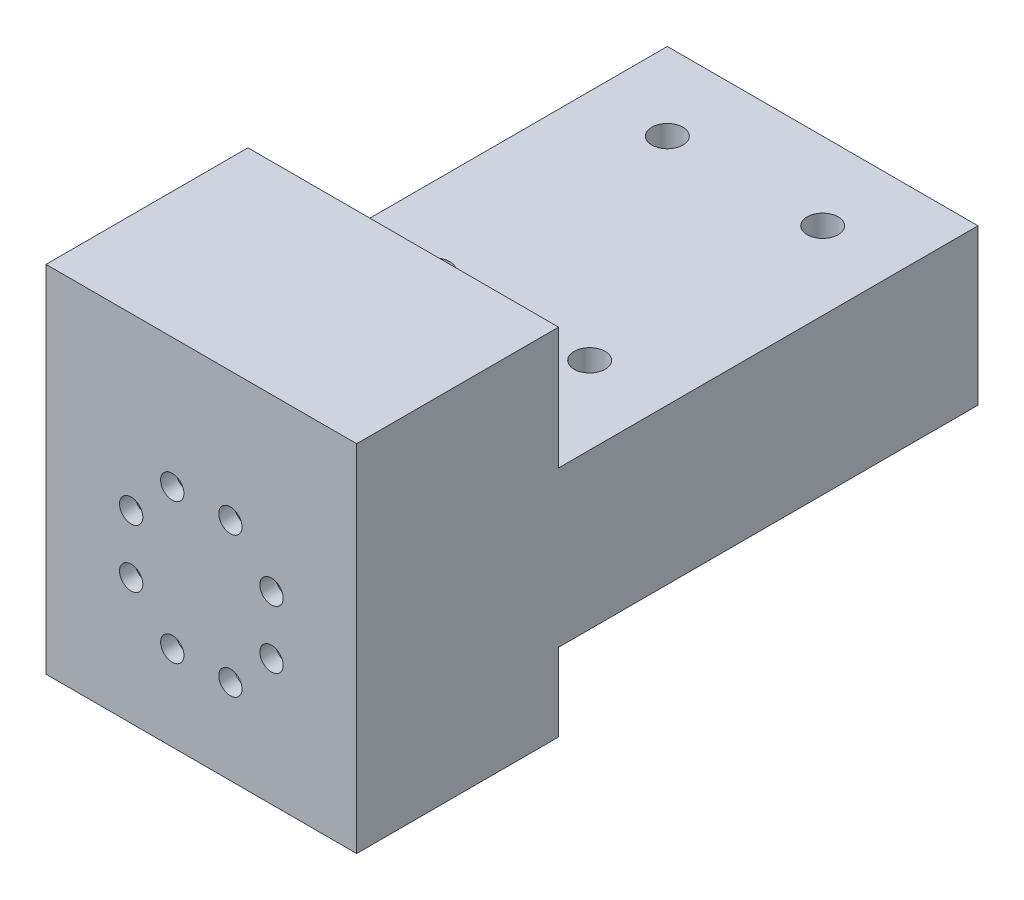
ISO-10303-21;
HEADER;
FILE_DESCRIPTION(('STEP AP214'),'2;1');
FILE_NAME('part.step','',(''),(''),'','','');
FILE_SCHEMA(('AUTOMOTIVE_DESIGN { 1 0 10303 214 1 1 1 1 }'));
ENDSEC;
DATA;
#1=APPLICATION_CONTEXT('core data for automotive mechanical design processes');
#2=APPLICATION_PROTOCOL_DEFINITION('international standard','automotive_design',2000,#1);
#3=PRODUCT_CONTEXT('',#1,'mechanical');
#4=PRODUCT('Part','Part','',(#3));
#5=PRODUCT_RELATED_PRODUCT_CATEGORY('part','',(#4));
#6=PRODUCT_DEFINITION_FORMATION('','',#4);
#7=PRODUCT_DEFINITION_CONTEXT('part definition',#1,'design');
#8=PRODUCT_DEFINITION('design','',#6,#7);
#9=PRODUCT_DEFINITION_SHAPE('','',#8);
#10=(LENGTH_UNIT() NAMED_UNIT(*) SI_UNIT(.MILLI.,.METRE.));
#11=(NAMED_UNIT(*) PLANE_ANGLE_UNIT() SI_UNIT($,.RADIAN.));
#12=(NAMED_UNIT(*) SI_UNIT($,.STERADIAN.) SOLID_ANGLE_UNIT());
#13=UNCERTAINTY_MEASURE_WITH_UNIT(LENGTH_MEASURE(1.E-05),#10,'distance_accuracy_value','');
#14=(GEOMETRIC_REPRESENTATION_CONTEXT(3) GLOBAL_UNCERTAINTY_ASSIGNED_CONTEXT((#13)) GLOBAL_UNIT_ASSIGNED_CONTEXT((#10,
#11,#12)) REPRESENTATION_CONTEXT('',''));
#15=CARTESIAN_POINT('',(0.,0.,0.));
#16=DIRECTION('',(0.,0.,1.));
#17=DIRECTION('',(1.,0.,0.));
#18=AXIS2_PLACEMENT_3D('',#15,#16,#17);
#19=CARTESIAN_POINT('',(0.,0.,-23.9999999999999));
#20=DIRECTION('',(0.,0.,-0.999999999999998));
#21=DIRECTION('',(-0.999999999999997,0.,0.));
#22=AXIS2_PLACEMENT_3D('',#19,#20,#21);
#23=PLANE('',#22);
#24=DIRECTION('',(-0.999999999999997,0.,0.));
#25=VECTOR('',#24,1.);
#26=CARTESIAN_POINT('',(19.9999999999998,-9.99999999999998,-23.9999999999999));
#27=LINE('',#26,#25);
#28=CARTESIAN_POINT('',(19.9999999999998,-10.,-23.9999999999999));
#29=VERTEX_POINT('',#28);
#30=CARTESIAN_POINT('',(-19.9999999999999,-10.,-23.9999999999999));
#31=VERTEX_POINT('',#30);
#32=EDGE_CURVE('E183',#29,#31,#27,.T.);
#33=ORIENTED_EDGE('',*,*,#32,.F.);
#34=DIRECTION('',(0.,-0.999999999999999,0.));
#35=VECTOR('',#34,1.);
#36=CARTESIAN_POINT('',(19.9999999999999,20.0000000000001,-23.9999999999998));
#37=LINE('',#36,#35);
#38=CARTESIAN_POINT('',(19.9999999999999,-20.,-23.9999999999999));
#39=VERTEX_POINT('',#38);
#40=EDGE_CURVE('E223',#29,#39,#37,.T.);
#41=ORIENTED_EDGE('',*,*,#40,.T.);
#42=DIRECTION('',(-0.999999999999997,0.,0.));
#43=VECTOR('',#42,1.);
#44=CARTESIAN_POINT('',(19.9999999999999,-20.,-23.9999999999999));
#45=LINE('',#44,#43);
#46=CARTESIAN_POINT('',(-20.,-19.9999999999998,-23.9999999999999));
#47=VERTEX_POINT('',#46);
#48=EDGE_CURVE('E222',#39,#47,#45,.T.);
#49=ORIENTED_EDGE('',*,*,#48,.T.);
#50=DIRECTION('',(0.,0.999999999999999,0.));
#51=VECTOR('',#50,1.);
#52=CARTESIAN_POINT('',(-19.9999999999999,20.,-23.9999999999999));
#53=LINE('',#52,#51);
#54=EDGE_CURVE('E227',#47,#31,#53,.T.);
#55=ORIENTED_EDGE('',*,*,#54,.T.);
#56=EDGE_LOOP('',(#33,#41,#49,#55));
#57=FACE_BOUND('',#56,.T.);
#58=ADVANCED_FACE('F38',(#57),#23,.T.);
#59=CARTESIAN_POINT('',(19.9999999999998,20.0000000000001,4.00000000000011));
#60=DIRECTION('',(-0.999999999999997,0.,0.));
#61=DIRECTION('',(0.,-0.999999999999999,0.));
#62=AXIS2_PLACEMENT_3D('',#59,#60,#61);
#63=PLANE('',#62);
#64=DIRECTION('',(0.,0.,0.999999999999998));
#65=VECTOR('',#64,1.);
#66=CARTESIAN_POINT('',(19.9999999999997,-9.99999999999984,-104.));
#67=LINE('',#66,#65);
#68=CARTESIAN_POINT('',(19.9999999999998,-9.99999999999998,-77.9999999999997));
#69=VERTEX_POINT('',#68);
#70=EDGE_CURVE('E189',#69,#29,#67,.T.);
#71=ORIENTED_EDGE('',*,*,#70,.F.);
#72=DIRECTION('',(0.,-0.999999999999999,0.));
#73=VECTOR('',#72,1.);
#74=CARTESIAN_POINT('',(19.9999999999997,10.0000000000001,-77.9999999999997));
#75=LINE('',#74,#73);
#76=CARTESIAN_POINT('',(19.9999999999997,10.0000000000001,-77.9999999999997));
#77=VERTEX_POINT('',#76);
#78=EDGE_CURVE('E55',#77,#69,#75,.T.);
#79=ORIENTED_EDGE('',*,*,#78,.F.);
#80=DIRECTION('',(0.,0.,0.999999999999998));
#81=VECTOR('',#80,1.);
#82=CARTESIAN_POINT('',(19.9999999999997,9.99999999999998,-104.));
#83=LINE('',#82,#81);
#84=CARTESIAN_POINT('',(19.9999999999998,10.0000000000002,-23.9999999999999));
#85=VERTEX_POINT('',#84);
#86=EDGE_CURVE('E191',#77,#85,#83,.T.);
#87=ORIENTED_EDGE('',*,*,#86,.T.);
#88=CARTESIAN_POINT('',(20.,25.7,-23.9999999999999));
#89=VERTEX_POINT('',#88);
#90=EDGE_CURVE('E219',#89,#85,#37,.T.);
#91=ORIENTED_EDGE('',*,*,#90,.F.);
#92=DIRECTION('',(0.,0.,-1.));
#93=VECTOR('',#92,1.);
#94=CARTESIAN_POINT('',(20.,25.7,-23.9999999999999));
#95=LINE('',#94,#93);
#96=CARTESIAN_POINT('',(20.,25.7,2.));
#97=VERTEX_POINT('',#96);
#98=EDGE_CURVE('E150',#97,#89,#95,.T.);
#99=ORIENTED_EDGE('',*,*,#98,.F.);
#100=DIRECTION('',(0.,0.999999999999999,0.));
#101=VECTOR('',#100,1.);
#102=CARTESIAN_POINT('',(20.,20.,2.));
#103=LINE('',#102,#101);
#104=CARTESIAN_POINT('',(19.9999999999999,-20.,2.00000000000011));
#105=VERTEX_POINT('',#104);
#106=EDGE_CURVE('E146',#105,#97,#103,.T.);
#107=ORIENTED_EDGE('',*,*,#106,.F.);
#108=DIRECTION('',(0.,0.,-0.999999999999998));
#109=VECTOR('',#108,1.);
#110=CARTESIAN_POINT('',(19.9999999999999,-19.9999999999998,4.));
#111=LINE('',#110,#109);
#112=EDGE_CURVE('E47',#105,#39,#111,.T.);
#113=ORIENTED_EDGE('',*,*,#112,.T.);
#114=ORIENTED_EDGE('',*,*,#40,.F.);
#115=EDGE_LOOP('',(#71,#79,#87,#91,#99,#107,#113,#114));
#116=FACE_BOUND('',#115,.T.);
#117=ADVANCED_FACE('F40',(#116),#63,.F.);
#118=CARTESIAN_POINT('',(-19.9999999999999,20.,3.99999999999995));
#119=DIRECTION('',(0.999999999999997,0.,0.));
#120=DIRECTION('',(0.,0.999999999999999,0.));
#121=AXIS2_PLACEMENT_3D('',#118,#119,#120);
#122=PLANE('',#121);
#123=DIRECTION('',(0.,0.,0.999999999999998));
#124=VECTOR('',#123,1.);
#125=CARTESIAN_POINT('',(-19.9999999999999,10.,-104.));
#126=LINE('',#125,#124);
#127=CARTESIAN_POINT('',(-19.9999999999999,10.0000000000002,-78.));
#128=VERTEX_POINT('',#127);
#129=CARTESIAN_POINT('',(-19.9999999999999,10.0000000000001,-23.9999999999999));
#130=VERTEX_POINT('',#129);
#131=EDGE_CURVE('E63',#128,#130,#126,.T.);
#132=ORIENTED_EDGE('',*,*,#131,.F.);
#133=DIRECTION('',(0.,0.999999999999999,0.));
#134=VECTOR('',#133,1.);
#135=CARTESIAN_POINT('',(-19.9999999999999,10.0000000000002,-78.));
#136=LINE('',#135,#134);
#137=CARTESIAN_POINT('',(-20.,-9.99999999999993,-77.9999999999997));
#138=VERTEX_POINT('',#137);
#139=EDGE_CURVE('E160',#138,#128,#136,.T.);
#140=ORIENTED_EDGE('',*,*,#139,.F.);
#141=DIRECTION('',(0.,0.,0.999999999999998));
#142=VECTOR('',#141,1.);
#143=CARTESIAN_POINT('',(-20.0000000000001,-9.99999999999984,-104.));
#144=LINE('',#143,#142);
#145=EDGE_CURVE('E187',#138,#31,#144,.T.);
#146=ORIENTED_EDGE('',*,*,#145,.T.);
#147=ORIENTED_EDGE('',*,*,#54,.F.);
#148=DIRECTION('',(0.,0.,-0.999999999999998));
#149=VECTOR('',#148,1.);
#150=CARTESIAN_POINT('',(-19.9999999999999,-20.,3.99999999999995));
#151=LINE('',#150,#149);
#152=CARTESIAN_POINT('',(-20.,-20.,2.));
#153=VERTEX_POINT('',#152);
#154=EDGE_CURVE('E11',#153,#47,#151,.T.);
#155=ORIENTED_EDGE('',*,*,#154,.F.);
#156=DIRECTION('',(0.,-0.999999999999999,0.));
#157=VECTOR('',#156,1.);
#158=CARTESIAN_POINT('',(-20.,20.0000000000001,2.));
#159=LINE('',#158,#157);
#160=CARTESIAN_POINT('',(-19.9999999999999,25.7,2.));
#161=VERTEX_POINT('',#160);
#162=EDGE_CURVE('E130',#161,#153,#159,.T.);
#163=ORIENTED_EDGE('',*,*,#162,.F.);
#164=DIRECTION('',(0.,0.,1.));
#165=VECTOR('',#164,1.);
#166=CARTESIAN_POINT('',(-19.9999999999999,25.7,-23.9999999999999));
#167=LINE('',#166,#165);
#168=CARTESIAN_POINT('',(-19.9999999999999,25.7,-23.9999999999999));
#169=VERTEX_POINT('',#168);
#170=EDGE_CURVE('E135',#169,#161,#167,.T.);
#171=ORIENTED_EDGE('',*,*,#170,.F.);
#172=EDGE_CURVE('E226',#130,#169,#53,.T.);
#173=ORIENTED_EDGE('',*,*,#172,.F.);
#174=EDGE_LOOP('',(#132,#140,#146,#147,#155,#163,#171,#173));
#175=FACE_BOUND('',#174,.T.);
#176=ADVANCED_FACE('F132',(#175),#122,.F.);
#177=CARTESIAN_POINT('',(-19.9999999999999,-20.,3.99999999999995));
#178=DIRECTION('',(0.,0.999999999999999,0.));
#179=DIRECTION('',(0.,0.,0.999999999999998));
#180=AXIS2_PLACEMENT_3D('',#177,#178,#179);
#181=PLANE('',#180);
#182=DIRECTION('',(-0.999999999999997,0.,0.));
#183=VECTOR('',#182,1.);
#184=CARTESIAN_POINT('',(19.9999999999999,-20.,-19.9999999999999));
#185=LINE('',#184,#183);
#186=CARTESIAN_POINT('',(15.9999999999999,-19.9999999999999,-19.9999999999998));
#187=VERTEX_POINT('',#186);
#188=CARTESIAN_POINT('',(-16.0000000000002,-20.,-19.9999999999998));
#189=VERTEX_POINT('',#188);
#190=EDGE_CURVE('E218',#187,#189,#185,.T.);
#191=ORIENTED_EDGE('',*,*,#190,.T.);
#192=DIRECTION('',(0.,0.,0.999999999999998));
#193=VECTOR('',#192,1.);
#194=CARTESIAN_POINT('',(-16.0000000000002,-20.,-19.9999999999998));
#195=LINE('',#194,#193);
#196=CARTESIAN_POINT('',(-16.,-20.,1.11022302462516E-13));
#197=VERTEX_POINT('',#196);
#198=EDGE_CURVE('E256',#189,#197,#195,.T.);
#199=ORIENTED_EDGE('',*,*,#198,.T.);
#200=DIRECTION('',(0.999999999999997,0.,0.));
#201=VECTOR('',#200,1.);
#202=CARTESIAN_POINT('',(-20.,-20.,0.));
#203=LINE('',#202,#201);
#204=CARTESIAN_POINT('',(16.,-20.,0.));
#205=VERTEX_POINT('',#204);
#206=EDGE_CURVE('E282',#197,#205,#203,.T.);
#207=ORIENTED_EDGE('',*,*,#206,.T.);
#208=DIRECTION('',(0.,0.,0.999999999999998));
#209=VECTOR('',#208,1.);
#210=CARTESIAN_POINT('',(15.9999999999999,-19.9999999999999,-19.9999999999998));
#211=LINE('',#210,#209);
#212=EDGE_CURVE('E254',#187,#205,#211,.T.);
#213=ORIENTED_EDGE('',*,*,#212,.F.);
#214=EDGE_LOOP('',(#191,#199,#207,#213));
#215=FACE_BOUND('',#214,.T.);
#216=DIRECTION('',(0.999999999999997,0.,0.));
#217=VECTOR('',#216,1.);
#218=CARTESIAN_POINT('',(-20.,-20.,2.));
#219=LINE('',#218,#217);
#220=EDGE_CURVE('E139',#153,#105,#219,.T.);
#221=ORIENTED_EDGE('',*,*,#220,.F.);
#222=ORIENTED_EDGE('',*,*,#154,.T.);
#223=ORIENTED_EDGE('',*,*,#48,.F.);
#224=ORIENTED_EDGE('',*,*,#112,.F.);
#225=EDGE_LOOP('',(#221,#222,#223,#224));
#226=FACE_BOUND('',#225,.T.);
#227=ADVANCED_FACE('F346',(#215,#226),#181,.F.);
#228=CARTESIAN_POINT('',(-9.03461794842793,-3.74226128509794,0.));
#229=DIRECTION('',(0.,0.,0.999999999999998));
#230=DIRECTION('',(0.999999999999997,0.,0.));
#231=AXIS2_PLACEMENT_3D('',#228,#229,#230);
#232=CYLINDRICAL_SURFACE('',#231,1.5);
#233=CARTESIAN_POINT('',(-9.03461794842793,-3.74226128509794,0.));
#234=DIRECTION('',(0.,0.,0.999999999999998));
#235=DIRECTION('',(0.999999999999997,0.,0.));
#236=AXIS2_PLACEMENT_3D('',#233,#234,#235);
#237=CIRCLE('',#236,1.5);
#238=CARTESIAN_POINT('',(-7.53461794842793,-3.74226128509794,0.));
#239=VERTEX_POINT('',#238);
#240=EDGE_CURVE('E262',#239,#239,#237,.T.);
#241=ORIENTED_EDGE('',*,*,#240,.F.);
#242=EDGE_LOOP('',(#241));
#243=FACE_BOUND('',#242,.T.);
#244=CARTESIAN_POINT('',(-9.0346179484279,-3.74226128509822,2.));
#245=DIRECTION('',(0.,0.,0.999999999999998));
#246=DIRECTION('',(0.999999999999997,0.,0.));
#247=AXIS2_PLACEMENT_3D('',#244,#245,#246);
#248=CIRCLE('',#247,1.5);
#249=CARTESIAN_POINT('',(-7.53461794842791,-3.74226128509822,2.));
#250=VERTEX_POINT('',#249);
#251=EDGE_CURVE('E215',#250,#250,#248,.F.);
#252=ORIENTED_EDGE('',*,*,#251,.F.);
#253=EDGE_LOOP('',(#252));
#254=FACE_BOUND('',#253,.T.);
#255=ADVANCED_FACE('F348',(#243,#254),#232,.F.);
#256=CARTESIAN_POINT('',(-9.03461794842787,3.74226128509827,0.));
#257=DIRECTION('',(0.,0.,0.999999999999998));
#258=DIRECTION('',(0.999999999999997,0.,0.));
#259=AXIS2_PLACEMENT_3D('',#256,#257,#258);
#260=CYLINDRICAL_SURFACE('',#259,1.5);
#261=CARTESIAN_POINT('',(-9.03461794842787,3.74226128509827,0.));
#262=DIRECTION('',(0.,0.,0.999999999999998));
#263=DIRECTION('',(0.999999999999997,0.,0.));
#264=AXIS2_PLACEMENT_3D('',#261,#262,#263);
#265=CIRCLE('',#264,1.5);
#266=CARTESIAN_POINT('',(-7.53461794842788,3.74226128509827,0.));
#267=VERTEX_POINT('',#266);
#268=EDGE_CURVE('E259',#267,#267,#265,.T.);
#269=ORIENTED_EDGE('',*,*,#268,.F.);
#270=EDGE_LOOP('',(#269));
#271=FACE_BOUND('',#270,.T.);
#272=CARTESIAN_POINT('',(-9.03461794842786,3.7422612850983,2.));
#273=DIRECTION('',(0.,0.,0.999999999999998));
#274=DIRECTION('',(0.999999999999997,0.,0.));
#275=AXIS2_PLACEMENT_3D('',#272,#273,#274);
#276=CIRCLE('',#275,1.5);
#277=CARTESIAN_POINT('',(-7.53461794842786,3.7422612850983,2.));
#278=VERTEX_POINT('',#277);
#279=EDGE_CURVE('E212',#278,#278,#276,.F.);
#280=ORIENTED_EDGE('',*,*,#279,.F.);
#281=EDGE_LOOP('',(#280));
#282=FACE_BOUND('',#281,.T.);
#283=ADVANCED_FACE('F355',(#271,#282),#260,.F.);
#284=CARTESIAN_POINT('',(-3.74226128509816,9.03461794842786,0.));
#285=DIRECTION('',(0.,0.,0.999999999999998));
#286=DIRECTION('',(0.999999999999997,0.,0.));
#287=AXIS2_PLACEMENT_3D('',#284,#285,#286);
#288=CYLINDRICAL_SURFACE('',#287,1.5);
#289=CARTESIAN_POINT('',(-3.74226128509816,9.03461794842786,0.));
#290=DIRECTION('',(0.,0.,0.999999999999998));
#291=DIRECTION('',(0.999999999999997,0.,0.));
#292=AXIS2_PLACEMENT_3D('',#289,#290,#291);
#293=CIRCLE('',#292,1.5);
#294=CARTESIAN_POINT('',(-2.24226128509817,9.03461794842786,0.));
#295=VERTEX_POINT('',#294);
#296=EDGE_CURVE('E263',#295,#295,#293,.T.);
#297=ORIENTED_EDGE('',*,*,#296,.F.);
#298=EDGE_LOOP('',(#297));
#299=FACE_BOUND('',#298,.T.);
#300=CARTESIAN_POINT('',(-3.74226128509822,9.03461794842786,2.00000000000022));
#301=DIRECTION('',(0.,0.,0.999999999999998));
#302=DIRECTION('',(0.999999999999997,0.,0.));
#303=AXIS2_PLACEMENT_3D('',#300,#301,#302);
#304=CIRCLE('',#303,1.5);
#305=CARTESIAN_POINT('',(-2.24226128509822,9.03461794842786,2.00000000000022));
#306=VERTEX_POINT('',#305);
#307=EDGE_CURVE('E209',#306,#306,#304,.F.);
#308=ORIENTED_EDGE('',*,*,#307,.F.);
#309=EDGE_LOOP('',(#308));
#310=FACE_BOUND('',#309,.T.);
#311=ADVANCED_FACE('F383',(#299,#310),#288,.F.);
#312=CARTESIAN_POINT('',(3.7422612850983,9.03461794842786,0.));
#313=DIRECTION('',(0.,0.,0.999999999999998));
#314=DIRECTION('',(0.999999999999997,0.,0.));
#315=AXIS2_PLACEMENT_3D('',#312,#313,#314);
#316=CYLINDRICAL_SURFACE('',#315,1.5);
#317=CARTESIAN_POINT('',(3.7422612850983,9.03461794842786,0.));
#318=DIRECTION('',(0.,0.,0.999999999999998));
#319=DIRECTION('',(0.999999999999997,0.,0.));
#320=AXIS2_PLACEMENT_3D('',#317,#318,#319);
#321=CIRCLE('',#320,1.5);
#322=CARTESIAN_POINT('',(5.2422612850983,9.03461794842786,0.));
#323=VERTEX_POINT('',#322);
#324=EDGE_CURVE('E266',#323,#323,#321,.T.);
#325=ORIENTED_EDGE('',*,*,#324,.F.);
#326=EDGE_LOOP('',(#325));
#327=FACE_BOUND('',#326,.T.);
#328=CARTESIAN_POINT('',(3.74226128509821,9.034617948428,2.00000000000022));
#329=DIRECTION('',(0.,0.,0.999999999999998));
#330=DIRECTION('',(0.999999999999997,0.,0.));
#331=AXIS2_PLACEMENT_3D('',#328,#329,#330);
#332=CIRCLE('',#331,1.5);
#333=CARTESIAN_POINT('',(5.2422612850982,9.034617948428,2.00000000000022));
#334=VERTEX_POINT('',#333);
#335=EDGE_CURVE('E206',#334,#334,#332,.F.);
#336=ORIENTED_EDGE('',*,*,#335,.F.);
#337=EDGE_LOOP('',(#336));
#338=FACE_BOUND('',#337,.T.);
#339=ADVANCED_FACE('F379',(#327,#338),#316,.F.);
#340=CARTESIAN_POINT('',(9.03461794842775,3.74226128509814,0.));
#341=DIRECTION('',(0.,0.,0.999999999999998));
#342=DIRECTION('',(0.999999999999997,0.,0.));
#343=AXIS2_PLACEMENT_3D('',#340,#341,#342);
#344=CYLINDRICAL_SURFACE('',#343,1.5);
#345=CARTESIAN_POINT('',(9.03461794842775,3.74226128509814,0.));
#346=DIRECTION('',(0.,0.,0.999999999999998));
#347=DIRECTION('',(0.999999999999997,0.,0.));
#348=AXIS2_PLACEMENT_3D('',#345,#346,#347);
#349=CIRCLE('',#348,1.5);
#350=CARTESIAN_POINT('',(10.5346179484277,3.74226128509814,0.));
#351=VERTEX_POINT('',#350);
#352=EDGE_CURVE('E269',#351,#351,#349,.T.);
#353=ORIENTED_EDGE('',*,*,#352,.F.);
#354=EDGE_LOOP('',(#353));
#355=FACE_BOUND('',#354,.T.);
#356=CARTESIAN_POINT('',(9.03461794842789,3.74226128509814,2.00000000000017));
#357=DIRECTION('',(0.,0.,0.999999999999998));
#358=DIRECTION('',(0.999999999999997,0.,0.));
#359=AXIS2_PLACEMENT_3D('',#356,#357,#358);
#360=CIRCLE('',#359,1.5);
#361=CARTESIAN_POINT('',(10.5346179484279,3.74226128509814,2.00000000000017));
#362=VERTEX_POINT('',#361);
#363=EDGE_CURVE('E203',#362,#362,#360,.F.);
#364=ORIENTED_EDGE('',*,*,#363,.F.);
#365=EDGE_LOOP('',(#364));
#366=FACE_BOUND('',#365,.T.);
#367=ADVANCED_FACE('F375',(#355,#366),#344,.F.);
#368=CARTESIAN_POINT('',(9.0346179484278,-3.74226128509819,0.));
#369=DIRECTION('',(0.,0.,0.999999999999998));
#370=DIRECTION('',(0.999999999999997,0.,0.));
#371=AXIS2_PLACEMENT_3D('',#368,#369,#370);
#372=CYLINDRICAL_SURFACE('',#371,1.5);
#373=CARTESIAN_POINT('',(9.0346179484278,-3.74226128509819,0.));
#374=DIRECTION('',(0.,0.,0.999999999999998));
#375=DIRECTION('',(0.999999999999997,0.,0.));
#376=AXIS2_PLACEMENT_3D('',#373,#374,#375);
#377=CIRCLE('',#376,1.5);
#378=CARTESIAN_POINT('',(10.5346179484278,-3.74226128509819,0.));
#379=VERTEX_POINT('',#378);
#380=EDGE_CURVE('E272',#379,#379,#377,.T.);
#381=ORIENTED_EDGE('',*,*,#380,.F.);
#382=EDGE_LOOP('',(#381));
#383=FACE_BOUND('',#382,.T.);
#384=CARTESIAN_POINT('',(9.03461794842778,-3.74226128509819,2.00000000000028));
#385=DIRECTION('',(0.,0.,0.999999999999998));
#386=DIRECTION('',(0.999999999999997,0.,0.));
#387=AXIS2_PLACEMENT_3D('',#384,#385,#386);
#388=CIRCLE('',#387,1.5);
#389=CARTESIAN_POINT('',(10.5346179484278,-3.74226128509819,2.00000000000028));
#390=VERTEX_POINT('',#389);
#391=EDGE_CURVE('E200',#390,#390,#388,.F.);
#392=ORIENTED_EDGE('',*,*,#391,.F.);
#393=EDGE_LOOP('',(#392));
#394=FACE_BOUND('',#393,.T.);
#395=ADVANCED_FACE('F371',(#383,#394),#372,.F.);
#396=CARTESIAN_POINT('',(3.74226128509819,-9.03461794842786,-1.11022302462516E-13));
#397=DIRECTION('',(0.,0.,0.999999999999998));
#398=DIRECTION('',(0.999999999999997,0.,0.));
#399=AXIS2_PLACEMENT_3D('',#396,#397,#398);
#400=CYLINDRICAL_SURFACE('',#399,1.5);
#401=CARTESIAN_POINT('',(3.74226128509819,-9.03461794842786,-1.11022302462516E-13));
#402=DIRECTION('',(0.,0.,0.999999999999998));
#403=DIRECTION('',(0.999999999999997,0.,0.));
#404=AXIS2_PLACEMENT_3D('',#401,#402,#403);
#405=CIRCLE('',#404,1.5);
#406=CARTESIAN_POINT('',(5.24226128509819,-9.03461794842786,-1.09939835013506E-13));
#407=VERTEX_POINT('',#406);
#408=EDGE_CURVE('E275',#407,#407,#405,.T.);
#409=ORIENTED_EDGE('',*,*,#408,.F.);
#410=EDGE_LOOP('',(#409));
#411=FACE_BOUND('',#410,.T.);
#412=CARTESIAN_POINT('',(3.74226128509811,-9.03461794842761,2.00000000000022));
#413=DIRECTION('',(0.,0.,0.999999999999998));
#414=DIRECTION('',(0.999999999999997,0.,0.));
#415=AXIS2_PLACEMENT_3D('',#412,#413,#414);
#416=CIRCLE('',#415,1.5);
#417=CARTESIAN_POINT('',(5.2422612850981,-9.03461794842761,2.00000000000022));
#418=VERTEX_POINT('',#417);
#419=EDGE_CURVE('E197',#418,#418,#416,.F.);
#420=ORIENTED_EDGE('',*,*,#419,.F.);
#421=EDGE_LOOP('',(#420));
#422=FACE_BOUND('',#421,.T.);
#423=ADVANCED_FACE('F367',(#411,#422),#400,.F.);
#424=CARTESIAN_POINT('',(-3.74226128509827,-9.03461794842786,-1.11022302462516E-13));
#425=DIRECTION('',(0.,0.,0.999999999999998));
#426=DIRECTION('',(0.999999999999997,0.,0.));
#427=AXIS2_PLACEMENT_3D('',#424,#425,#426);
#428=CYLINDRICAL_SURFACE('',#427,1.5);
#429=CARTESIAN_POINT('',(-3.74226128509827,-9.03461794842786,-1.11022302462516E-13));
#430=DIRECTION('',(0.,0.,0.999999999999998));
#431=DIRECTION('',(0.999999999999997,0.,0.));
#432=AXIS2_PLACEMENT_3D('',#429,#430,#431);
#433=CIRCLE('',#432,1.5);
#434=CARTESIAN_POINT('',(-2.24226128509828,-9.03461794842786,-1.09939835013506E-13));
#435=VERTEX_POINT('',#434);
#436=EDGE_CURVE('E258',#435,#435,#433,.T.);
#437=ORIENTED_EDGE('',*,*,#436,.F.);
#438=EDGE_LOOP('',(#437));
#439=FACE_BOUND('',#438,.T.);
#440=CARTESIAN_POINT('',(-3.74226128509819,-9.03461794842786,2.));
#441=DIRECTION('',(0.,0.,0.999999999999998));
#442=DIRECTION('',(0.999999999999997,0.,0.));
#443=AXIS2_PLACEMENT_3D('',#440,#441,#442);
#444=CIRCLE('',#443,1.5);
#445=CARTESIAN_POINT('',(-2.2422612850982,-9.03461794842786,2.));
#446=VERTEX_POINT('',#445);
#447=EDGE_CURVE('E196',#446,#446,#444,.F.);
#448=ORIENTED_EDGE('',*,*,#447,.F.);
#449=EDGE_LOOP('',(#448));
#450=FACE_BOUND('',#449,.T.);
#451=ADVANCED_FACE('F362',(#439,#450),#428,.F.);
#452=CARTESIAN_POINT('',(0.,0.,0.));
#453=DIRECTION('',(0.,0.,0.999999999999998));
#454=DIRECTION('',(0.999999999999997,0.,0.));
#455=AXIS2_PLACEMENT_3D('',#452,#453,#454);
#456=PLANE('',#455);
#457=ORIENTED_EDGE('',*,*,#436,.T.);
#458=EDGE_LOOP('',(#457));
#459=FACE_BOUND('',#458,.T.);
#460=ORIENTED_EDGE('',*,*,#408,.T.);
#461=EDGE_LOOP('',(#460));
#462=FACE_BOUND('',#461,.T.);
#463=ORIENTED_EDGE('',*,*,#380,.T.);
#464=EDGE_LOOP('',(#463));
#465=FACE_BOUND('',#464,.T.);
#466=ORIENTED_EDGE('',*,*,#352,.T.);
#467=EDGE_LOOP('',(#466));
#468=FACE_BOUND('',#467,.T.);
#469=ORIENTED_EDGE('',*,*,#324,.T.);
#470=EDGE_LOOP('',(#469));
#471=FACE_BOUND('',#470,.T.);
#472=ORIENTED_EDGE('',*,*,#296,.T.);
#473=EDGE_LOOP('',(#472));
#474=FACE_BOUND('',#473,.T.);
#475=ORIENTED_EDGE('',*,*,#268,.T.);
#476=EDGE_LOOP('',(#475));
#477=FACE_BOUND('',#476,.T.);
#478=ORIENTED_EDGE('',*,*,#240,.T.);
#479=EDGE_LOOP('',(#478));
#480=FACE_BOUND('',#479,.T.);
#481=ORIENTED_EDGE('',*,*,#206,.F.);
#482=DIRECTION('',(0.,1.,0.));
#483=VECTOR('',#482,1.);
#484=CARTESIAN_POINT('',(-16.,0.,0.));
#485=LINE('',#484,#483);
#486=CARTESIAN_POINT('',(-16.,16.,0.));
#487=VERTEX_POINT('',#486);
#488=EDGE_CURVE('E230',#197,#487,#485,.T.);
#489=ORIENTED_EDGE('',*,*,#488,.T.);
#490=DIRECTION('',(0.999999999999997,0.,0.));
#491=VECTOR('',#490,1.);
#492=CARTESIAN_POINT('',(0.,16.,0.));
#493=LINE('',#492,#491);
#494=CARTESIAN_POINT('',(15.9999999999999,16.0000000000001,1.11022302462516E-13));
#495=VERTEX_POINT('',#494);
#496=EDGE_CURVE('E237',#487,#495,#493,.T.);
#497=ORIENTED_EDGE('',*,*,#496,.T.);
#498=DIRECTION('',(0.,-0.999999999999999,0.));
#499=VECTOR('',#498,1.);
#500=CARTESIAN_POINT('',(16.,0.,0.));
#501=LINE('',#500,#499);
#502=EDGE_CURVE('E246',#495,#205,#501,.T.);
#503=ORIENTED_EDGE('',*,*,#502,.T.);
#504=EDGE_LOOP('',(#481,#489,#497,#503));
#505=FACE_BOUND('',#504,.T.);
#506=ADVANCED_FACE('F359',(#459,#462,#465,#468,#471,#474,#477,#480,#505),#456,.F.);
#507=CARTESIAN_POINT('',(-16.,0.,-19.9999999999999));
#508=DIRECTION('',(0.999999999999997,0.,0.));
#509=DIRECTION('',(0.,1.,0.));
#510=AXIS2_PLACEMENT_3D('',#507,#508,#509);
#511=PLANE('',#510);
#512=ORIENTED_EDGE('',*,*,#488,.F.);
#513=ORIENTED_EDGE('',*,*,#198,.F.);
#514=DIRECTION('',(0.,1.,0.));
#515=VECTOR('',#514,1.);
#516=CARTESIAN_POINT('',(-16.,0.,-19.9999999999999));
#517=LINE('',#516,#515);
#518=CARTESIAN_POINT('',(-16.,16.,-19.9999999999999));
#519=VERTEX_POINT('',#518);
#520=EDGE_CURVE('E233',#189,#519,#517,.T.);
#521=ORIENTED_EDGE('',*,*,#520,.T.);
#522=DIRECTION('',(0.,0.,0.999999999999998));
#523=VECTOR('',#522,1.);
#524=CARTESIAN_POINT('',(-16.,16.,-19.9999999999999));
#525=LINE('',#524,#523);
#526=EDGE_CURVE('E243',#519,#487,#525,.T.);
#527=ORIENTED_EDGE('',*,*,#526,.T.);
#528=EDGE_LOOP('',(#512,#513,#521,#527));
#529=FACE_BOUND('',#528,.T.);
#530=ADVANCED_FACE('F361',(#529),#511,.T.);
#531=CARTESIAN_POINT('',(16.,0.,-19.9999999999999));
#532=DIRECTION('',(-0.999999999999997,0.,0.));
#533=DIRECTION('',(0.,-0.999999999999999,0.));
#534=AXIS2_PLACEMENT_3D('',#531,#532,#533);
#535=PLANE('',#534);
#536=ORIENTED_EDGE('',*,*,#502,.F.);
#537=DIRECTION('',(0.,0.,0.999999999999998));
#538=VECTOR('',#537,1.);
#539=CARTESIAN_POINT('',(15.9999999999999,15.9999999999999,-19.9999999999999));
#540=LINE('',#539,#538);
#541=CARTESIAN_POINT('',(15.9999999999999,15.9999999999999,-19.9999999999999));
#542=VERTEX_POINT('',#541);
#543=EDGE_CURVE('E252',#542,#495,#540,.T.);
#544=ORIENTED_EDGE('',*,*,#543,.F.);
#545=DIRECTION('',(0.,-0.999999999999999,0.));
#546=VECTOR('',#545,1.);
#547=CARTESIAN_POINT('',(16.,0.,-19.9999999999999));
#548=LINE('',#547,#546);
#549=EDGE_CURVE('E236',#542,#187,#548,.T.);
#550=ORIENTED_EDGE('',*,*,#549,.T.);
#551=ORIENTED_EDGE('',*,*,#212,.T.);
#552=EDGE_LOOP('',(#536,#544,#550,#551));
#553=FACE_BOUND('',#552,.T.);
#554=ADVANCED_FACE('F334',(#553),#535,.T.);
#555=CARTESIAN_POINT('',(0.,16.,-19.9999999999999));
#556=DIRECTION('',(0.,-0.999999999999999,0.));
#557=DIRECTION('',(0.999999999999997,0.,0.));
#558=AXIS2_PLACEMENT_3D('',#555,#556,#557);
#559=PLANE('',#558);
#560=ORIENTED_EDGE('',*,*,#496,.F.);
#561=ORIENTED_EDGE('',*,*,#526,.F.);
#562=DIRECTION('',(0.999999999999997,0.,0.));
#563=VECTOR('',#562,1.);
#564=CARTESIAN_POINT('',(0.,16.,-19.9999999999999));
#565=LINE('',#564,#563);
#566=EDGE_CURVE('E240',#519,#542,#565,.T.);
#567=ORIENTED_EDGE('',*,*,#566,.T.);
#568=ORIENTED_EDGE('',*,*,#543,.T.);
#569=EDGE_LOOP('',(#560,#561,#567,#568));
#570=FACE_BOUND('',#569,.T.);
#571=ADVANCED_FACE('F327',(#570),#559,.T.);
#572=DIRECTION('',(0.999999999999997,0.,0.));
#573=VECTOR('',#572,1.);
#574=CARTESIAN_POINT('',(19.9999999999998,10.0000000000002,-23.9999999999999));
#575=LINE('',#574,#573);
#576=EDGE_CURVE('E181',#130,#85,#575,.T.);
#577=ORIENTED_EDGE('',*,*,#576,.F.);
#578=ORIENTED_EDGE('',*,*,#172,.T.);
#579=DIRECTION('',(-1.,0.,0.));
#580=VECTOR('',#579,1.);
#581=CARTESIAN_POINT('',(-19.9999999999999,25.7,-23.9999999999999));
#582=LINE('',#581,#580);
#583=EDGE_CURVE('E155',#89,#169,#582,.T.);
#584=ORIENTED_EDGE('',*,*,#583,.F.);
#585=ORIENTED_EDGE('',*,*,#90,.T.);
#586=EDGE_LOOP('',(#577,#578,#584,#585));
#587=FACE_BOUND('',#586,.T.);
#588=ADVANCED_FACE('F317',(#587),#23,.T.);
#589=CARTESIAN_POINT('',(-1.66533453693773E-13,0.,-19.9999999999999));
#590=DIRECTION('',(0.,0.,-0.999999999999998));
#591=DIRECTION('',(-0.999999999999997,0.,0.));
#592=AXIS2_PLACEMENT_3D('',#589,#590,#591);
#593=PLANE('',#592);
#594=ORIENTED_EDGE('',*,*,#520,.F.);
#595=ORIENTED_EDGE('',*,*,#190,.F.);
#596=ORIENTED_EDGE('',*,*,#549,.F.);
#597=ORIENTED_EDGE('',*,*,#566,.F.);
#598=EDGE_LOOP('',(#594,#595,#596,#597));
#599=FACE_BOUND('',#598,.T.);
#600=ADVANCED_FACE('F326',(#599),#593,.F.);
#601=CARTESIAN_POINT('',(0.,0.,2.00000000000006));
#602=DIRECTION('',(0.,0.,0.999999999999998));
#603=DIRECTION('',(0.999999999999997,0.,0.));
#604=AXIS2_PLACEMENT_3D('',#601,#602,#603);
#605=PLANE('',#604);
#606=ORIENTED_EDGE('',*,*,#162,.T.);
#607=ORIENTED_EDGE('',*,*,#220,.T.);
#608=ORIENTED_EDGE('',*,*,#106,.T.);
#609=DIRECTION('',(1.,0.,0.));
#610=VECTOR('',#609,1.);
#611=CARTESIAN_POINT('',(-19.9999999999999,25.7,2.));
#612=LINE('',#611,#610);
#613=EDGE_CURVE('E142',#161,#97,#612,.T.);
#614=ORIENTED_EDGE('',*,*,#613,.F.);
#615=EDGE_LOOP('',(#606,#607,#608,#614));
#616=FACE_BOUND('',#615,.T.);
#617=ORIENTED_EDGE('',*,*,#447,.T.);
#618=EDGE_LOOP('',(#617));
#619=FACE_BOUND('',#618,.T.);
#620=ORIENTED_EDGE('',*,*,#419,.T.);
#621=EDGE_LOOP('',(#620));
#622=FACE_BOUND('',#621,.T.);
#623=ORIENTED_EDGE('',*,*,#391,.T.);
#624=EDGE_LOOP('',(#623));
#625=FACE_BOUND('',#624,.T.);
#626=ORIENTED_EDGE('',*,*,#363,.T.);
#627=EDGE_LOOP('',(#626));
#628=FACE_BOUND('',#627,.T.);
#629=ORIENTED_EDGE('',*,*,#335,.T.);
#630=EDGE_LOOP('',(#629));
#631=FACE_BOUND('',#630,.T.);
#632=ORIENTED_EDGE('',*,*,#307,.T.);
#633=EDGE_LOOP('',(#632));
#634=FACE_BOUND('',#633,.T.);
#635=ORIENTED_EDGE('',*,*,#279,.T.);
#636=EDGE_LOOP('',(#635));
#637=FACE_BOUND('',#636,.T.);
#638=ORIENTED_EDGE('',*,*,#251,.T.);
#639=EDGE_LOOP('',(#638));
#640=FACE_BOUND('',#639,.T.);
#641=ADVANCED_FACE('F143',(#616,#619,#622,#625,#628,#631,#634,#637,#640),#605,.T.);
#642=CARTESIAN_POINT('',(19.9999999999997,9.99999999999998,-104.));
#643=DIRECTION('',(0.,-0.999999999999999,0.));
#644=DIRECTION('',(0.,0.,-0.999999999999998));
#645=AXIS2_PLACEMENT_3D('',#642,#643,#644);
#646=PLANE('',#645);
#647=CARTESIAN_POINT('',(9.99999999999997,9.99999999999998,-67.9999999999999));
#648=DIRECTION('',(0.,0.999999999999999,0.));
#649=DIRECTION('',(0.,0.,0.999999999999998));
#650=AXIS2_PLACEMENT_3D('',#647,#648,#649);
#651=CIRCLE('',#650,2.);
#652=CARTESIAN_POINT('',(9.99999999999997,9.99999999999998,-65.9999999999999));
#653=VERTEX_POINT('',#652);
#654=EDGE_CURVE('E168',#653,#653,#651,.T.);
#655=ORIENTED_EDGE('',*,*,#654,.F.);
#656=EDGE_LOOP('',(#655));
#657=FACE_BOUND('',#656,.T.);
#658=CARTESIAN_POINT('',(-10.,9.9999999999999,-67.9999999999998));
#659=DIRECTION('',(0.,0.999999999999999,0.));
#660=DIRECTION('',(0.,0.,0.999999999999998));
#661=AXIS2_PLACEMENT_3D('',#658,#659,#660);
#662=CIRCLE('',#661,2.);
#663=CARTESIAN_POINT('',(-10.,9.9999999999999,-65.9999999999998));
#664=VERTEX_POINT('',#663);
#665=EDGE_CURVE('E167',#664,#664,#662,.T.);
#666=ORIENTED_EDGE('',*,*,#665,.F.);
#667=EDGE_LOOP('',(#666));
#668=FACE_BOUND('',#667,.T.);
#669=CARTESIAN_POINT('',(-10.,10.,-37.9999999999999));
#670=DIRECTION('',(0.,0.999999999999999,0.));
#671=DIRECTION('',(0.,0.,0.999999999999998));
#672=AXIS2_PLACEMENT_3D('',#669,#670,#671);
#673=CIRCLE('',#672,2.);
#674=CARTESIAN_POINT('',(-10.,10.,-35.9999999999999));
#675=VERTEX_POINT('',#674);
#676=EDGE_CURVE('E174',#675,#675,#673,.T.);
#677=ORIENTED_EDGE('',*,*,#676,.F.);
#678=EDGE_LOOP('',(#677));
#679=FACE_BOUND('',#678,.T.);
#680=CARTESIAN_POINT('',(9.99999999999982,9.9999999999999,-37.9999999999997));
#681=DIRECTION('',(0.,0.999999999999999,0.));
#682=DIRECTION('',(0.,0.,0.999999999999998));
#683=AXIS2_PLACEMENT_3D('',#680,#681,#682);
#684=CIRCLE('',#683,2.);
#685=CARTESIAN_POINT('',(9.99999999999982,9.9999999999999,-35.9999999999997));
#686=VERTEX_POINT('',#685);
#687=EDGE_CURVE('E178',#686,#686,#684,.T.);
#688=ORIENTED_EDGE('',*,*,#687,.F.);
#689=EDGE_LOOP('',(#688));
#690=FACE_BOUND('',#689,.T.);
#691=ORIENTED_EDGE('',*,*,#86,.F.);
#692=DIRECTION('',(0.999999999999997,0.,0.));
#693=VECTOR('',#692,1.);
#694=CARTESIAN_POINT('',(-19.9999999999999,10.0000000000002,-78.));
#695=LINE('',#694,#693);
#696=EDGE_CURVE('E162',#128,#77,#695,.T.);
#697=ORIENTED_EDGE('',*,*,#696,.F.);
#698=ORIENTED_EDGE('',*,*,#131,.T.);
#699=ORIENTED_EDGE('',*,*,#576,.T.);
#700=EDGE_LOOP('',(#691,#697,#698,#699));
#701=FACE_BOUND('',#700,.T.);
#702=ADVANCED_FACE('F435',(#657,#668,#679,#690,#701),#646,.F.);
#703=CARTESIAN_POINT('',(19.9999999999997,-9.99999999999984,-104.));
#704=DIRECTION('',(0.,0.999999999999999,0.));
#705=DIRECTION('',(0.,0.,0.999999999999998));
#706=AXIS2_PLACEMENT_3D('',#703,#704,#705);
#707=PLANE('',#706);
#708=CARTESIAN_POINT('',(9.99999999999987,-9.99999999999995,-67.9999999999997));
#709=DIRECTION('',(0.,0.999999999999999,0.));
#710=DIRECTION('',(0.,0.,0.999999999999998));
#711=AXIS2_PLACEMENT_3D('',#708,#709,#710);
#712=CIRCLE('',#711,2.);
#713=CARTESIAN_POINT('',(9.99999999999987,-9.99999999999996,-65.9999999999997));
#714=VERTEX_POINT('',#713);
#715=EDGE_CURVE('E42',#714,#714,#712,.T.);
#716=ORIENTED_EDGE('',*,*,#715,.T.);
#717=EDGE_LOOP('',(#716));
#718=FACE_BOUND('',#717,.T.);
#719=CARTESIAN_POINT('',(-10.0000000000001,-9.99999999999995,-67.9999999999998));
#720=DIRECTION('',(0.,0.999999999999999,0.));
#721=DIRECTION('',(0.,0.,0.999999999999998));
#722=AXIS2_PLACEMENT_3D('',#719,#720,#721);
#723=CIRCLE('',#722,2.);
#724=CARTESIAN_POINT('',(-10.0000000000001,-9.99999999999996,-65.9999999999998));
#725=VERTEX_POINT('',#724);
#726=EDGE_CURVE('E171',#725,#725,#723,.T.);
#727=ORIENTED_EDGE('',*,*,#726,.T.);
#728=EDGE_LOOP('',(#727));
#729=FACE_BOUND('',#728,.T.);
#730=CARTESIAN_POINT('',(-10.0000000000001,-10.,-37.9999999999997));
#731=DIRECTION('',(0.,0.999999999999999,0.));
#732=DIRECTION('',(0.,0.,0.999999999999998));
#733=AXIS2_PLACEMENT_3D('',#730,#731,#732);
#734=CIRCLE('',#733,2.);
#735=CARTESIAN_POINT('',(-10.0000000000001,-10.,-35.9999999999997));
#736=VERTEX_POINT('',#735);
#737=EDGE_CURVE('E184',#736,#736,#734,.T.);
#738=ORIENTED_EDGE('',*,*,#737,.T.);
#739=EDGE_LOOP('',(#738));
#740=FACE_BOUND('',#739,.T.);
#741=CARTESIAN_POINT('',(9.99999999999994,-10.,-37.9999999999999));
#742=DIRECTION('',(0.,0.999999999999999,0.));
#743=DIRECTION('',(0.,0.,0.999999999999998));
#744=AXIS2_PLACEMENT_3D('',#741,#742,#743);
#745=CIRCLE('',#744,2.);
#746=CARTESIAN_POINT('',(9.99999999999994,-10.,-35.9999999999999));
#747=VERTEX_POINT('',#746);
#748=EDGE_CURVE('E177',#747,#747,#745,.T.);
#749=ORIENTED_EDGE('',*,*,#748,.T.);
#750=EDGE_LOOP('',(#749));
#751=FACE_BOUND('',#750,.T.);
#752=ORIENTED_EDGE('',*,*,#145,.F.);
#753=DIRECTION('',(-0.999999999999997,0.,0.));
#754=VECTOR('',#753,1.);
#755=CARTESIAN_POINT('',(-20.,-9.99999999999993,-77.9999999999997));
#756=LINE('',#755,#754);
#757=EDGE_CURVE('E165',#69,#138,#756,.T.);
#758=ORIENTED_EDGE('',*,*,#757,.F.);
#759=ORIENTED_EDGE('',*,*,#70,.T.);
#760=ORIENTED_EDGE('',*,*,#32,.T.);
#761=EDGE_LOOP('',(#752,#758,#759,#760));
#762=FACE_BOUND('',#761,.T.);
#763=ADVANCED_FACE('F298',(#718,#729,#740,#751,#762),#707,.F.);
#764=CARTESIAN_POINT('',(9.99999999999986,-19.9999999999999,-37.9999999999996));
#765=DIRECTION('',(0.,0.999999999999999,0.));
#766=DIRECTION('',(0.,0.,0.999999999999998));
#767=AXIS2_PLACEMENT_3D('',#764,#765,#766);
#768=CYLINDRICAL_SURFACE('',#767,2.);
#769=ORIENTED_EDGE('',*,*,#687,.T.);
#770=EDGE_LOOP('',(#769));
#771=FACE_BOUND('',#770,.T.);
#772=ORIENTED_EDGE('',*,*,#748,.F.);
#773=EDGE_LOOP('',(#772));
#774=FACE_BOUND('',#773,.T.);
#775=ADVANCED_FACE('F455',(#771,#774),#768,.F.);
#776=CARTESIAN_POINT('',(-10.0000000000001,-20.0000000000002,-37.9999999999997));
#777=DIRECTION('',(0.,0.999999999999999,0.));
#778=DIRECTION('',(0.,0.,0.999999999999998));
#779=AXIS2_PLACEMENT_3D('',#776,#777,#778);
#780=CYLINDRICAL_SURFACE('',#779,2.);
#781=ORIENTED_EDGE('',*,*,#676,.T.);
#782=EDGE_LOOP('',(#781));
#783=FACE_BOUND('',#782,.T.);
#784=ORIENTED_EDGE('',*,*,#737,.F.);
#785=EDGE_LOOP('',(#784));
#786=FACE_BOUND('',#785,.T.);
#787=ADVANCED_FACE('F311',(#783,#786),#780,.F.);
#788=CARTESIAN_POINT('',(-10.,-19.9999999999999,-67.9999999999999));
#789=DIRECTION('',(0.,0.999999999999999,0.));
#790=DIRECTION('',(0.,0.,0.999999999999998));
#791=AXIS2_PLACEMENT_3D('',#788,#789,#790);
#792=CYLINDRICAL_SURFACE('',#791,2.);
#793=ORIENTED_EDGE('',*,*,#665,.T.);
#794=EDGE_LOOP('',(#793));
#795=FACE_BOUND('',#794,.T.);
#796=ORIENTED_EDGE('',*,*,#726,.F.);
#797=EDGE_LOOP('',(#796));
#798=FACE_BOUND('',#797,.T.);
#799=ADVANCED_FACE('F303',(#795,#798),#792,.F.);
#800=CARTESIAN_POINT('',(9.99999999999993,-19.9999999999998,-67.9999999999998));
#801=DIRECTION('',(0.,0.999999999999999,0.));
#802=DIRECTION('',(0.,0.,0.999999999999998));
#803=AXIS2_PLACEMENT_3D('',#800,#801,#802);
#804=CYLINDRICAL_SURFACE('',#803,2.);
#805=ORIENTED_EDGE('',*,*,#654,.T.);
#806=EDGE_LOOP('',(#805));
#807=FACE_BOUND('',#806,.T.);
#808=ORIENTED_EDGE('',*,*,#715,.F.);
#809=EDGE_LOOP('',(#808));
#810=FACE_BOUND('',#809,.T.);
#811=ADVANCED_FACE('F300',(#807,#810),#804,.F.);
#812=CARTESIAN_POINT('',(0.,0.,-77.9999999999998));
#813=DIRECTION('',(0.,0.,0.999999999999998));
#814=DIRECTION('',(0.999999999999997,0.,0.));
#815=AXIS2_PLACEMENT_3D('',#812,#813,#814);
#816=PLANE('',#815);
#817=ORIENTED_EDGE('',*,*,#139,.T.);
#818=ORIENTED_EDGE('',*,*,#696,.T.);
#819=ORIENTED_EDGE('',*,*,#78,.T.);
#820=ORIENTED_EDGE('',*,*,#757,.T.);
#821=EDGE_LOOP('',(#817,#818,#819,#820));
#822=FACE_BOUND('',#821,.T.);
#823=ADVANCED_FACE('F302',(#822),#816,.F.);
#824=CARTESIAN_POINT('',(0.,25.7,0.));
#825=DIRECTION('',(0.,1.,0.));
#826=DIRECTION('',(0.,0.,1.));
#827=AXIS2_PLACEMENT_3D('',#824,#825,#826);
#828=PLANE('',#827);
#829=ORIENTED_EDGE('',*,*,#170,.T.);
#830=ORIENTED_EDGE('',*,*,#613,.T.);
#831=ORIENTED_EDGE('',*,*,#98,.T.);
#832=ORIENTED_EDGE('',*,*,#583,.T.);
#833=EDGE_LOOP('',(#829,#830,#831,#832));
#834=FACE_BOUND('',#833,.T.);
#835=ADVANCED_FACE('F153',(#834),#828,.T.);
#836=CLOSED_SHELL('',(#58,#117,#176,#227,#255,#283,#311,#339,#367,#395,#423,#451,#506,#530,#554,
#571,#588,#600,#641,#702,#763,#775,#787,#799,#811,#823,#835));
#837=MANIFOLD_SOLID_BREP('B2',#836);
#838=ADVANCED_BREP_SHAPE_REPRESENTATION('',(#18,#837),#14);
#839=SHAPE_DEFINITION_REPRESENTATION(#9,#838);
ENDSEC;
END-ISO-10303-21;
